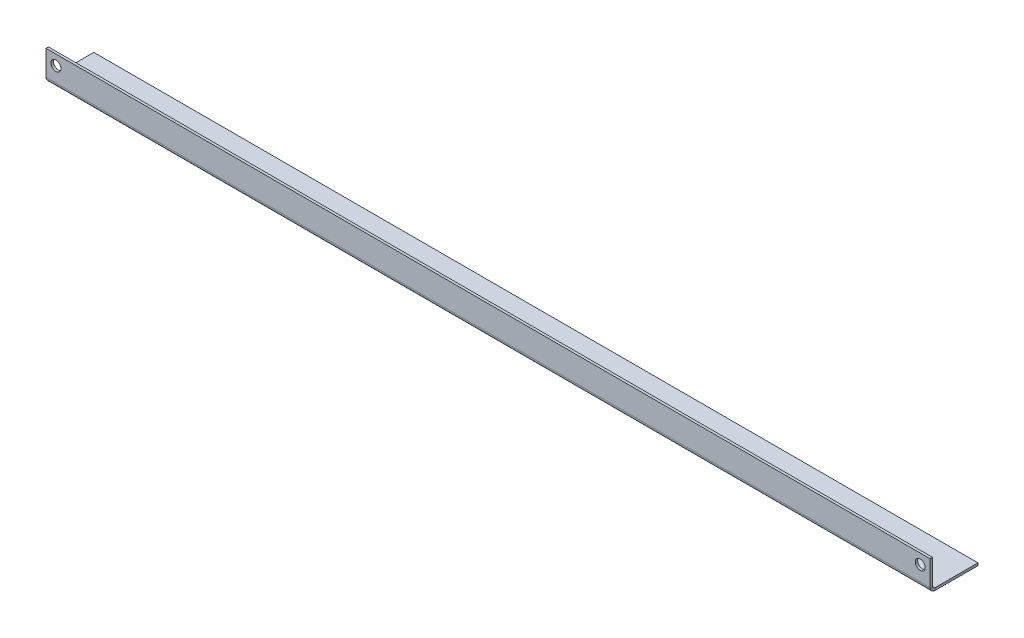
ISO-10303-21;
HEADER;
FILE_DESCRIPTION(('STEP AP214'),'2;1');
FILE_NAME('part.step','',(''),(''),'','','');
FILE_SCHEMA(('AUTOMOTIVE_DESIGN { 1 0 10303 214 1 1 1 1 }'));
ENDSEC;
DATA;
#1=APPLICATION_CONTEXT('core data for automotive mechanical design processes');
#2=APPLICATION_PROTOCOL_DEFINITION('international standard','automotive_design',2000,#1);
#3=PRODUCT_CONTEXT('',#1,'mechanical');
#4=PRODUCT('Part','Part','',(#3));
#5=PRODUCT_RELATED_PRODUCT_CATEGORY('part','',(#4));
#6=PRODUCT_DEFINITION_FORMATION('','',#4);
#7=PRODUCT_DEFINITION_CONTEXT('part definition',#1,'design');
#8=PRODUCT_DEFINITION('design','',#6,#7);
#9=PRODUCT_DEFINITION_SHAPE('','',#8);
#10=(LENGTH_UNIT() NAMED_UNIT(*) SI_UNIT(.MILLI.,.METRE.));
#11=(NAMED_UNIT(*) PLANE_ANGLE_UNIT() SI_UNIT($,.RADIAN.));
#12=(NAMED_UNIT(*) SI_UNIT($,.STERADIAN.) SOLID_ANGLE_UNIT());
#13=UNCERTAINTY_MEASURE_WITH_UNIT(LENGTH_MEASURE(1.E-05),#10,'distance_accuracy_value','');
#14=(GEOMETRIC_REPRESENTATION_CONTEXT(3) GLOBAL_UNCERTAINTY_ASSIGNED_CONTEXT((#13)) GLOBAL_UNIT_ASSIGNED_CONTEXT((#10,
#11,#12)) REPRESENTATION_CONTEXT('',''));
#15=CARTESIAN_POINT('',(0.,0.,0.));
#16=DIRECTION('',(0.,0.,1.));
#17=DIRECTION('',(1.,0.,0.));
#18=AXIS2_PLACEMENT_3D('',#15,#16,#17);
#19=CARTESIAN_POINT('',(222.,1.214,12.));
#20=DIRECTION('',(-1.,0.,0.));
#21=DIRECTION('',(0.,0.,1.));
#22=AXIS2_PLACEMENT_3D('',#19,#20,#21);
#23=PLANE('',#22);
#24=DIRECTION('',(0.,-1.,0.));
#25=VECTOR('',#24,1.);
#26=CARTESIAN_POINT('',(222.,1.21399999999999,9.572));
#27=LINE('',#26,#25);
#28=CARTESIAN_POINT('',(222.,1.21399999999999,9.572));
#29=VERTEX_POINT('',#28);
#30=CARTESIAN_POINT('',(222.,0.,9.572));
#31=VERTEX_POINT('',#30);
#32=EDGE_CURVE('E173',#29,#31,#27,.T.);
#33=ORIENTED_EDGE('',*,*,#32,.T.);
#34=DIRECTION('',(0.,0.,-1.));
#35=VECTOR('',#34,1.);
#36=CARTESIAN_POINT('',(222.,0.,12.));
#37=LINE('',#36,#35);
#38=CARTESIAN_POINT('',(222.,0.,-12.));
#39=VERTEX_POINT('',#38);
#40=EDGE_CURVE('E105',#31,#39,#37,.T.);
#41=ORIENTED_EDGE('',*,*,#40,.T.);
#42=DIRECTION('',(0.,-1.,0.));
#43=VECTOR('',#42,1.);
#44=CARTESIAN_POINT('',(222.,1.214,-12.));
#45=LINE('',#44,#43);
#46=CARTESIAN_POINT('',(222.,1.214,-12.));
#47=VERTEX_POINT('',#46);
#48=EDGE_CURVE('E13',#47,#39,#45,.T.);
#49=ORIENTED_EDGE('',*,*,#48,.F.);
#50=DIRECTION('',(0.,0.,-1.));
#51=VECTOR('',#50,1.);
#52=CARTESIAN_POINT('',(222.,1.214,12.));
#53=LINE('',#52,#51);
#54=EDGE_CURVE('E116',#29,#47,#53,.T.);
#55=ORIENTED_EDGE('',*,*,#54,.F.);
#56=EDGE_LOOP('',(#33,#41,#49,#55));
#57=FACE_BOUND('',#56,.T.);
#58=ADVANCED_FACE('F59',(#57),#23,.F.);
#59=CARTESIAN_POINT('',(-222.,1.214,12.));
#60=DIRECTION('',(1.,0.,0.));
#61=DIRECTION('',(0.,0.,-1.));
#62=AXIS2_PLACEMENT_3D('',#59,#60,#61);
#63=PLANE('',#62);
#64=DIRECTION('',(0.,-1.,0.));
#65=VECTOR('',#64,1.);
#66=CARTESIAN_POINT('',(-222.,1.21399999999999,9.572));
#67=LINE('',#66,#65);
#68=CARTESIAN_POINT('',(-222.,1.21399999999999,9.572));
#69=VERTEX_POINT('',#68);
#70=CARTESIAN_POINT('',(-222.,0.,9.572));
#71=VERTEX_POINT('',#70);
#72=EDGE_CURVE('E184',#69,#71,#67,.T.);
#73=ORIENTED_EDGE('',*,*,#72,.F.);
#74=DIRECTION('',(0.,0.,1.));
#75=VECTOR('',#74,1.);
#76=CARTESIAN_POINT('',(-222.,1.214,12.));
#77=LINE('',#76,#75);
#78=CARTESIAN_POINT('',(-222.,1.214,-12.));
#79=VERTEX_POINT('',#78);
#80=EDGE_CURVE('E111',#79,#69,#77,.T.);
#81=ORIENTED_EDGE('',*,*,#80,.F.);
#82=DIRECTION('',(0.,-1.,0.));
#83=VECTOR('',#82,1.);
#84=CARTESIAN_POINT('',(-222.,1.214,-12.));
#85=LINE('',#84,#83);
#86=CARTESIAN_POINT('',(-222.,0.,-12.));
#87=VERTEX_POINT('',#86);
#88=EDGE_CURVE('E67',#79,#87,#85,.T.);
#89=ORIENTED_EDGE('',*,*,#88,.T.);
#90=DIRECTION('',(0.,0.,1.));
#91=VECTOR('',#90,1.);
#92=CARTESIAN_POINT('',(-222.,0.,12.));
#93=LINE('',#92,#91);
#94=EDGE_CURVE('E104',#87,#71,#93,.T.);
#95=ORIENTED_EDGE('',*,*,#94,.T.);
#96=EDGE_LOOP('',(#73,#81,#89,#95));
#97=FACE_BOUND('',#96,.T.);
#98=ADVANCED_FACE('F110',(#97),#63,.F.);
#99=CARTESIAN_POINT('',(0.,1.214,0.));
#100=DIRECTION('',(0.,-1.,0.));
#101=DIRECTION('',(0.,0.,-1.));
#102=AXIS2_PLACEMENT_3D('',#99,#100,#101);
#103=PLANE('',#102);
#104=DIRECTION('',(1.,0.,0.));
#105=VECTOR('',#104,1.);
#106=CARTESIAN_POINT('',(222.,1.21399999999999,9.572));
#107=LINE('',#106,#105);
#108=EDGE_CURVE('E179',#29,#69,#107,.F.);
#109=ORIENTED_EDGE('',*,*,#108,.F.);
#110=ORIENTED_EDGE('',*,*,#54,.T.);
#111=DIRECTION('',(-1.,0.,0.));
#112=VECTOR('',#111,1.);
#113=CARTESIAN_POINT('',(-222.,1.214,-12.));
#114=LINE('',#113,#112);
#115=EDGE_CURVE('E84',#47,#79,#114,.T.);
#116=ORIENTED_EDGE('',*,*,#115,.T.);
#117=ORIENTED_EDGE('',*,*,#80,.T.);
#118=EDGE_LOOP('',(#109,#110,#116,#117));
#119=FACE_BOUND('',#118,.T.);
#120=ADVANCED_FACE('F245',(#119),#103,.F.);
#121=CARTESIAN_POINT('',(0.,0.,0.));
#122=DIRECTION('',(0.,-1.,0.));
#123=DIRECTION('',(0.,0.,-1.));
#124=AXIS2_PLACEMENT_3D('',#121,#122,#123);
#125=PLANE('',#124);
#126=ORIENTED_EDGE('',*,*,#40,.F.);
#127=DIRECTION('',(1.,0.,0.));
#128=VECTOR('',#127,1.);
#129=CARTESIAN_POINT('',(222.,0.,9.572));
#130=LINE('',#129,#128);
#131=EDGE_CURVE('E115',#31,#71,#130,.F.);
#132=ORIENTED_EDGE('',*,*,#131,.T.);
#133=ORIENTED_EDGE('',*,*,#94,.F.);
#134=DIRECTION('',(-1.,0.,0.));
#135=VECTOR('',#134,1.);
#136=CARTESIAN_POINT('',(-222.,0.,-12.));
#137=LINE('',#136,#135);
#138=EDGE_CURVE('E96',#39,#87,#137,.T.);
#139=ORIENTED_EDGE('',*,*,#138,.F.);
#140=EDGE_LOOP('',(#126,#132,#133,#139));
#141=FACE_BOUND('',#140,.T.);
#142=ADVANCED_FACE('F114',(#141),#125,.T.);
#143=CARTESIAN_POINT('',(-222.,1.214,-12.));
#144=DIRECTION('',(0.,0.,1.));
#145=DIRECTION('',(1.,0.,0.));
#146=AXIS2_PLACEMENT_3D('',#143,#144,#145);
#147=PLANE('',#146);
#148=ORIENTED_EDGE('',*,*,#138,.T.);
#149=ORIENTED_EDGE('',*,*,#88,.F.);
#150=ORIENTED_EDGE('',*,*,#115,.F.);
#151=ORIENTED_EDGE('',*,*,#48,.T.);
#152=EDGE_LOOP('',(#148,#149,#150,#151));
#153=FACE_BOUND('',#152,.T.);
#154=ADVANCED_FACE('F98',(#153),#147,.F.);
#155=CARTESIAN_POINT('',(-222.,2.42799999999999,9.572));
#156=DIRECTION('',(-1.,0.,0.));
#157=DIRECTION('',(0.,0.,1.));
#158=AXIS2_PLACEMENT_3D('',#155,#156,#157);
#159=PLANE('',#158);
#160=DIRECTION('',(0.,0.,-1.));
#161=VECTOR('',#160,1.);
#162=CARTESIAN_POINT('',(-222.,2.428,12.));
#163=LINE('',#162,#161);
#164=CARTESIAN_POINT('',(-222.,2.42799999999999,10.786));
#165=VERTEX_POINT('',#164);
#166=CARTESIAN_POINT('',(-222.,2.42799999999999,12.));
#167=VERTEX_POINT('',#166);
#168=EDGE_CURVE('E126',#165,#167,#163,.F.);
#169=ORIENTED_EDGE('',*,*,#168,.F.);
#170=CARTESIAN_POINT('',(-222.,2.42799999999999,9.572));
#171=DIRECTION('',(1.,0.,0.));
#172=DIRECTION('',(0.,0.,-1.));
#173=AXIS2_PLACEMENT_3D('',#170,#171,#172);
#174=CIRCLE('',#173,1.214);
#175=EDGE_CURVE('E176',#69,#165,#174,.F.);
#176=ORIENTED_EDGE('',*,*,#175,.F.);
#177=ORIENTED_EDGE('',*,*,#72,.T.);
#178=CARTESIAN_POINT('',(-222.,2.42799999999999,9.572));
#179=DIRECTION('',(1.,0.,0.));
#180=DIRECTION('',(0.,0.,-1.));
#181=AXIS2_PLACEMENT_3D('',#178,#179,#180);
#182=CIRCLE('',#181,2.428);
#183=EDGE_CURVE('E75',#71,#167,#182,.F.);
#184=ORIENTED_EDGE('',*,*,#183,.T.);
#185=EDGE_LOOP('',(#169,#176,#177,#184));
#186=FACE_BOUND('',#185,.T.);
#187=ADVANCED_FACE('F244',(#186),#159,.T.);
#188=CARTESIAN_POINT('',(222.,2.42799999999999,9.572));
#189=DIRECTION('',(-1.,0.,0.));
#190=DIRECTION('',(0.,0.,1.));
#191=AXIS2_PLACEMENT_3D('',#188,#189,#190);
#192=PLANE('',#191);
#193=CARTESIAN_POINT('',(222.,2.42799999999999,9.572));
#194=DIRECTION('',(1.,0.,0.));
#195=DIRECTION('',(0.,0.,-1.));
#196=AXIS2_PLACEMENT_3D('',#193,#194,#195);
#197=CIRCLE('',#196,1.214);
#198=CARTESIAN_POINT('',(222.,2.42799999999999,10.786));
#199=VERTEX_POINT('',#198);
#200=EDGE_CURVE('E138',#199,#29,#197,.T.);
#201=ORIENTED_EDGE('',*,*,#200,.F.);
#202=DIRECTION('',(0.,0.,-1.));
#203=VECTOR('',#202,1.);
#204=CARTESIAN_POINT('',(222.,2.42799999999999,10.786));
#205=LINE('',#204,#203);
#206=CARTESIAN_POINT('',(222.,2.42799999999999,12.));
#207=VERTEX_POINT('',#206);
#208=EDGE_CURVE('E162',#199,#207,#205,.F.);
#209=ORIENTED_EDGE('',*,*,#208,.T.);
#210=CARTESIAN_POINT('',(222.,2.42799999999999,9.572));
#211=DIRECTION('',(1.,0.,0.));
#212=DIRECTION('',(0.,0.,-1.));
#213=AXIS2_PLACEMENT_3D('',#210,#211,#212);
#214=CIRCLE('',#213,2.428);
#215=EDGE_CURVE('E171',#207,#31,#214,.T.);
#216=ORIENTED_EDGE('',*,*,#215,.T.);
#217=ORIENTED_EDGE('',*,*,#32,.F.);
#218=EDGE_LOOP('',(#201,#209,#216,#217));
#219=FACE_BOUND('',#218,.T.);
#220=ADVANCED_FACE('F217',(#219),#192,.F.);
#221=CARTESIAN_POINT('',(222.,2.42799999999999,9.572));
#222=DIRECTION('',(1.,0.,0.));
#223=DIRECTION('',(0.,0.,1.));
#224=AXIS2_PLACEMENT_3D('',#221,#222,#223);
#225=CYLINDRICAL_SURFACE('',#224,2.428);
#226=ORIENTED_EDGE('',*,*,#131,.F.);
#227=ORIENTED_EDGE('',*,*,#215,.F.);
#228=DIRECTION('',(1.,0.,0.));
#229=VECTOR('',#228,1.);
#230=CARTESIAN_POINT('',(-222.,2.428,12.));
#231=LINE('',#230,#229);
#232=EDGE_CURVE('E160',#207,#167,#231,.F.);
#233=ORIENTED_EDGE('',*,*,#232,.T.);
#234=ORIENTED_EDGE('',*,*,#183,.F.);
#235=EDGE_LOOP('',(#226,#227,#233,#234));
#236=FACE_BOUND('',#235,.T.);
#237=ADVANCED_FACE('F242',(#236),#225,.T.);
#238=CARTESIAN_POINT('',(222.,2.42799999999999,9.572));
#239=DIRECTION('',(1.,0.,0.));
#240=DIRECTION('',(0.,0.,1.));
#241=AXIS2_PLACEMENT_3D('',#238,#239,#240);
#242=CYLINDRICAL_SURFACE('',#241,1.214);
#243=ORIENTED_EDGE('',*,*,#108,.T.);
#244=ORIENTED_EDGE('',*,*,#175,.T.);
#245=DIRECTION('',(1.,0.,0.));
#246=VECTOR('',#245,1.);
#247=CARTESIAN_POINT('',(-222.,2.428,10.786));
#248=LINE('',#247,#246);
#249=EDGE_CURVE('E165',#165,#199,#248,.T.);
#250=ORIENTED_EDGE('',*,*,#249,.T.);
#251=ORIENTED_EDGE('',*,*,#200,.T.);
#252=EDGE_LOOP('',(#243,#244,#250,#251));
#253=FACE_BOUND('',#252,.T.);
#254=ADVANCED_FACE('F209',(#253),#242,.F.);
#255=CARTESIAN_POINT('',(-222.,1.214,12.));
#256=DIRECTION('',(1.,0.,0.));
#257=DIRECTION('',(0.,0.,-1.));
#258=AXIS2_PLACEMENT_3D('',#255,#256,#257);
#259=PLANE('',#258);
#260=ORIENTED_EDGE('',*,*,#168,.T.);
#261=DIRECTION('',(0.,-1.,0.));
#262=VECTOR('',#261,1.);
#263=CARTESIAN_POINT('',(-222.,0.,12.));
#264=LINE('',#263,#262);
#265=CARTESIAN_POINT('',(-222.,15.,12.));
#266=VERTEX_POINT('',#265);
#267=EDGE_CURVE('E148',#266,#167,#264,.T.);
#268=ORIENTED_EDGE('',*,*,#267,.F.);
#269=DIRECTION('',(0.,0.,-1.));
#270=VECTOR('',#269,1.);
#271=CARTESIAN_POINT('',(-222.,15.,12.));
#272=LINE('',#271,#270);
#273=CARTESIAN_POINT('',(-222.,15.,10.786));
#274=VERTEX_POINT('',#273);
#275=EDGE_CURVE('E139',#266,#274,#272,.T.);
#276=ORIENTED_EDGE('',*,*,#275,.T.);
#277=DIRECTION('',(0.,1.,0.));
#278=VECTOR('',#277,1.);
#279=CARTESIAN_POINT('',(-222.,1.214,10.786));
#280=LINE('',#279,#278);
#281=EDGE_CURVE('E157',#274,#165,#280,.F.);
#282=ORIENTED_EDGE('',*,*,#281,.T.);
#283=EDGE_LOOP('',(#260,#268,#276,#282));
#284=FACE_BOUND('',#283,.T.);
#285=ADVANCED_FACE('F237',(#284),#259,.F.);
#286=CARTESIAN_POINT('',(222.,15.,12.));
#287=DIRECTION('',(-1.,0.,0.));
#288=DIRECTION('',(0.,0.,1.));
#289=AXIS2_PLACEMENT_3D('',#286,#287,#288);
#290=PLANE('',#289);
#291=ORIENTED_EDGE('',*,*,#208,.F.);
#292=DIRECTION('',(0.,-1.,0.));
#293=VECTOR('',#292,1.);
#294=CARTESIAN_POINT('',(222.,15.,10.786));
#295=LINE('',#294,#293);
#296=CARTESIAN_POINT('',(222.,15.,10.786));
#297=VERTEX_POINT('',#296);
#298=EDGE_CURVE('E154',#199,#297,#295,.F.);
#299=ORIENTED_EDGE('',*,*,#298,.T.);
#300=DIRECTION('',(0.,0.,-1.));
#301=VECTOR('',#300,1.);
#302=CARTESIAN_POINT('',(222.,15.,12.));
#303=LINE('',#302,#301);
#304=CARTESIAN_POINT('',(222.,15.,12.));
#305=VERTEX_POINT('',#304);
#306=EDGE_CURVE('E135',#305,#297,#303,.T.);
#307=ORIENTED_EDGE('',*,*,#306,.F.);
#308=DIRECTION('',(0.,1.,0.));
#309=VECTOR('',#308,1.);
#310=CARTESIAN_POINT('',(222.,0.,12.));
#311=LINE('',#310,#309);
#312=EDGE_CURVE('E145',#207,#305,#311,.T.);
#313=ORIENTED_EDGE('',*,*,#312,.F.);
#314=EDGE_LOOP('',(#291,#299,#307,#313));
#315=FACE_BOUND('',#314,.T.);
#316=ADVANCED_FACE('F222',(#315),#290,.F.);
#317=CARTESIAN_POINT('',(0.,0.,12.));
#318=DIRECTION('',(0.,0.,-1.));
#319=DIRECTION('',(-1.,0.,0.));
#320=AXIS2_PLACEMENT_3D('',#317,#318,#319);
#321=PLANE('',#320);
#322=CARTESIAN_POINT('',(217.,9.92800000000003,12.));
#323=DIRECTION('',(0.,0.,1.));
#324=DIRECTION('',(1.,0.,0.));
#325=AXIS2_PLACEMENT_3D('',#322,#323,#324);
#326=CIRCLE('',#325,2.5);
#327=CARTESIAN_POINT('',(219.5,9.92800000000003,12.));
#328=VERTEX_POINT('',#327);
#329=EDGE_CURVE('E122',#328,#328,#326,.T.);
#330=ORIENTED_EDGE('',*,*,#329,.F.);
#331=EDGE_LOOP('',(#330));
#332=FACE_BOUND('',#331,.T.);
#333=CARTESIAN_POINT('',(-217.,9.92800000000001,12.));
#334=DIRECTION('',(0.,0.,1.));
#335=DIRECTION('',(1.,0.,0.));
#336=AXIS2_PLACEMENT_3D('',#333,#334,#335);
#337=CIRCLE('',#336,2.5);
#338=CARTESIAN_POINT('',(-214.5,9.92800000000001,12.));
#339=VERTEX_POINT('',#338);
#340=EDGE_CURVE('E128',#339,#339,#337,.T.);
#341=ORIENTED_EDGE('',*,*,#340,.F.);
#342=EDGE_LOOP('',(#341));
#343=FACE_BOUND('',#342,.T.);
#344=ORIENTED_EDGE('',*,*,#232,.F.);
#345=ORIENTED_EDGE('',*,*,#312,.T.);
#346=DIRECTION('',(-1.,0.,0.));
#347=VECTOR('',#346,1.);
#348=CARTESIAN_POINT('',(0.,15.,12.));
#349=LINE('',#348,#347);
#350=EDGE_CURVE('E142',#305,#266,#349,.T.);
#351=ORIENTED_EDGE('',*,*,#350,.T.);
#352=ORIENTED_EDGE('',*,*,#267,.T.);
#353=EDGE_LOOP('',(#344,#345,#351,#352));
#354=FACE_BOUND('',#353,.T.);
#355=ADVANCED_FACE('F240',(#332,#343,#354),#321,.F.);
#356=CARTESIAN_POINT('',(0.,0.,10.786));
#357=DIRECTION('',(0.,0.,-1.));
#358=DIRECTION('',(-1.,0.,0.));
#359=AXIS2_PLACEMENT_3D('',#356,#357,#358);
#360=PLANE('',#359);
#361=CARTESIAN_POINT('',(217.,9.92800000000003,10.786));
#362=DIRECTION('',(0.,0.,-1.));
#363=DIRECTION('',(-1.,0.,0.));
#364=AXIS2_PLACEMENT_3D('',#361,#362,#363);
#365=CIRCLE('',#364,2.5);
#366=CARTESIAN_POINT('',(214.5,9.92800000000003,10.786));
#367=VERTEX_POINT('',#366);
#368=EDGE_CURVE('E62',#367,#367,#365,.T.);
#369=ORIENTED_EDGE('',*,*,#368,.F.);
#370=EDGE_LOOP('',(#369));
#371=FACE_BOUND('',#370,.T.);
#372=CARTESIAN_POINT('',(-217.,9.92800000000001,10.786));
#373=DIRECTION('',(0.,0.,-1.));
#374=DIRECTION('',(-1.,0.,0.));
#375=AXIS2_PLACEMENT_3D('',#372,#373,#374);
#376=CIRCLE('',#375,2.5);
#377=CARTESIAN_POINT('',(-219.5,9.92800000000001,10.786));
#378=VERTEX_POINT('',#377);
#379=EDGE_CURVE('E120',#378,#378,#376,.T.);
#380=ORIENTED_EDGE('',*,*,#379,.F.);
#381=EDGE_LOOP('',(#380));
#382=FACE_BOUND('',#381,.T.);
#383=ORIENTED_EDGE('',*,*,#298,.F.);
#384=ORIENTED_EDGE('',*,*,#249,.F.);
#385=ORIENTED_EDGE('',*,*,#281,.F.);
#386=DIRECTION('',(1.,0.,0.));
#387=VECTOR('',#386,1.);
#388=CARTESIAN_POINT('',(-222.,15.,10.786));
#389=LINE('',#388,#387);
#390=EDGE_CURVE('E151',#297,#274,#389,.F.);
#391=ORIENTED_EDGE('',*,*,#390,.F.);
#392=EDGE_LOOP('',(#383,#384,#385,#391));
#393=FACE_BOUND('',#392,.T.);
#394=ADVANCED_FACE('F226',(#371,#382,#393),#360,.T.);
#395=CARTESIAN_POINT('',(-222.,15.,12.));
#396=DIRECTION('',(0.,-1.,0.));
#397=DIRECTION('',(0.,0.,-1.));
#398=AXIS2_PLACEMENT_3D('',#395,#396,#397);
#399=PLANE('',#398);
#400=ORIENTED_EDGE('',*,*,#390,.T.);
#401=ORIENTED_EDGE('',*,*,#275,.F.);
#402=ORIENTED_EDGE('',*,*,#350,.F.);
#403=ORIENTED_EDGE('',*,*,#306,.T.);
#404=EDGE_LOOP('',(#400,#401,#402,#403));
#405=FACE_BOUND('',#404,.T.);
#406=ADVANCED_FACE('F231',(#405),#399,.F.);
#407=CARTESIAN_POINT('',(-217.,9.92800000000001,2.));
#408=DIRECTION('',(0.,0.,1.));
#409=DIRECTION('',(1.,0.,0.));
#410=AXIS2_PLACEMENT_3D('',#407,#408,#409);
#411=CYLINDRICAL_SURFACE('',#410,2.5);
#412=ORIENTED_EDGE('',*,*,#379,.T.);
#413=EDGE_LOOP('',(#412));
#414=FACE_BOUND('',#413,.T.);
#415=ORIENTED_EDGE('',*,*,#340,.T.);
#416=EDGE_LOOP('',(#415));
#417=FACE_BOUND('',#416,.T.);
#418=ADVANCED_FACE('F341',(#414,#417),#411,.F.);
#419=CARTESIAN_POINT('',(217.,9.92800000000003,2.));
#420=DIRECTION('',(0.,0.,1.));
#421=DIRECTION('',(1.,0.,0.));
#422=AXIS2_PLACEMENT_3D('',#419,#420,#421);
#423=CYLINDRICAL_SURFACE('',#422,2.5);
#424=ORIENTED_EDGE('',*,*,#368,.T.);
#425=EDGE_LOOP('',(#424));
#426=FACE_BOUND('',#425,.T.);
#427=ORIENTED_EDGE('',*,*,#329,.T.);
#428=EDGE_LOOP('',(#427));
#429=FACE_BOUND('',#428,.T.);
#430=ADVANCED_FACE('F369',(#426,#429),#423,.F.);
#431=CLOSED_SHELL('',(#58,#98,#120,#142,#154,#187,#220,#237,#254,#285,#316,#355,#394,#406,#418,#430));
#432=MANIFOLD_SOLID_BREP('B2',#431);
#433=ADVANCED_BREP_SHAPE_REPRESENTATION('',(#18,#432),#14);
#434=SHAPE_DEFINITION_REPRESENTATION(#9,#433);
ENDSEC;
END-ISO-10303-21;
